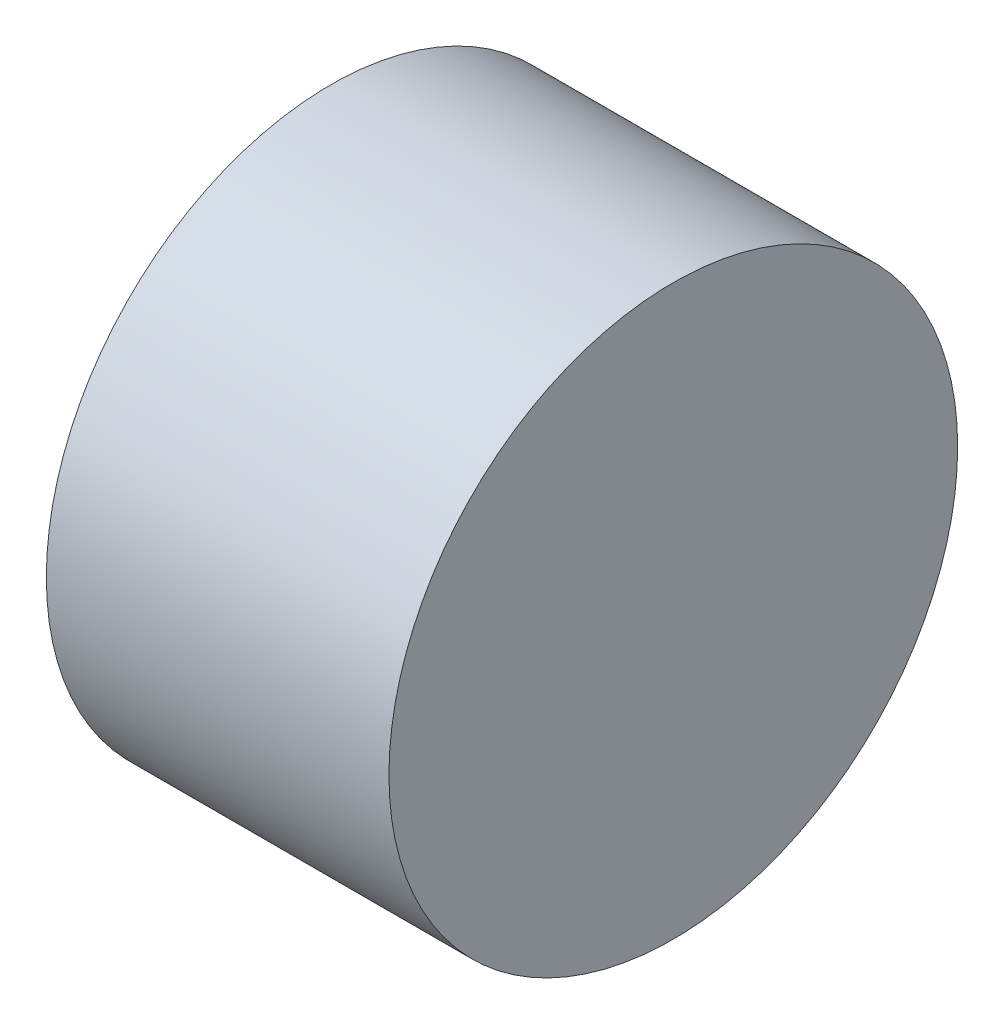
ISO-10303-21;
HEADER;
FILE_DESCRIPTION(('STEP AP214'),'2;1');
FILE_NAME('part.step','',(''),(''),'','','');
FILE_SCHEMA(('AUTOMOTIVE_DESIGN { 1 0 10303 214 1 1 1 1 }'));
ENDSEC;
DATA;
#1=APPLICATION_CONTEXT('core data for automotive mechanical design processes');
#2=APPLICATION_PROTOCOL_DEFINITION('international standard','automotive_design',2000,#1);
#3=PRODUCT_CONTEXT('',#1,'mechanical');
#4=PRODUCT('Part','Part','',(#3));
#5=PRODUCT_RELATED_PRODUCT_CATEGORY('part','',(#4));
#6=PRODUCT_DEFINITION_FORMATION('','',#4);
#7=PRODUCT_DEFINITION_CONTEXT('part definition',#1,'design');
#8=PRODUCT_DEFINITION('design','',#6,#7);
#9=PRODUCT_DEFINITION_SHAPE('','',#8);
#10=(LENGTH_UNIT() NAMED_UNIT(*) SI_UNIT(.MILLI.,.METRE.));
#11=(NAMED_UNIT(*) PLANE_ANGLE_UNIT() SI_UNIT($,.RADIAN.));
#12=(NAMED_UNIT(*) SI_UNIT($,.STERADIAN.) SOLID_ANGLE_UNIT());
#13=UNCERTAINTY_MEASURE_WITH_UNIT(LENGTH_MEASURE(1.E-05),#10,'distance_accuracy_value','');
#14=(GEOMETRIC_REPRESENTATION_CONTEXT(3) GLOBAL_UNCERTAINTY_ASSIGNED_CONTEXT((#13)) GLOBAL_UNIT_ASSIGNED_CONTEXT((#10,
#11,#12)) REPRESENTATION_CONTEXT('',''));
#15=CARTESIAN_POINT('',(0.,0.,0.));
#16=DIRECTION('',(0.,0.,1.));
#17=DIRECTION('',(1.,0.,0.));
#18=AXIS2_PLACEMENT_3D('',#15,#16,#17);
#19=CARTESIAN_POINT('',(0.,0.,0.));
#20=DIRECTION('',(1.,0.,0.));
#21=DIRECTION('',(0.,0.,-1.));
#22=AXIS2_PLACEMENT_3D('',#19,#20,#21);
#23=PLANE('',#22);
#24=CARTESIAN_POINT('',(0.,6.30311603335176E-13,11.1125000000006));
#25=DIRECTION('',(-1.,0.,0.));
#26=DIRECTION('',(0.,0.,1.));
#27=AXIS2_PLACEMENT_3D('',#24,#25,#26);
#28=CIRCLE('',#27,1.98437500000046);
#29=CARTESIAN_POINT('',(0.,6.30311603335176E-13,13.0968750000011));
#30=VERTEX_POINT('',#29);
#31=EDGE_CURVE('E63',#30,#30,#28,.T.);
#32=ORIENTED_EDGE('',*,*,#31,.F.);
#33=EDGE_LOOP('',(#32));
#34=FACE_BOUND('',#33,.T.);
#35=CARTESIAN_POINT('',(0.,-11.1125,1.26062320667035E-12));
#36=DIRECTION('',(-1.,0.,0.));
#37=DIRECTION('',(0.,0.,1.));
#38=AXIS2_PLACEMENT_3D('',#35,#36,#37);
#39=CIRCLE('',#38,1.98437500000128);
#40=CARTESIAN_POINT('',(0.,-11.1125,1.98437500000254));
#41=VERTEX_POINT('',#40);
#42=EDGE_CURVE('E57',#41,#41,#39,.T.);
#43=ORIENTED_EDGE('',*,*,#42,.F.);
#44=EDGE_LOOP('',(#43));
#45=FACE_BOUND('',#44,.T.);
#46=CARTESIAN_POINT('',(0.,-6.31672492090729E-13,-11.1124999999994));
#47=DIRECTION('',(-1.,0.,0.));
#48=DIRECTION('',(0.,0.,1.));
#49=AXIS2_PLACEMENT_3D('',#46,#47,#48);
#50=CIRCLE('',#49,1.9843750000009);
#51=CARTESIAN_POINT('',(0.,-6.31672492090729E-13,-9.12812499999847));
#52=VERTEX_POINT('',#51);
#53=EDGE_CURVE('E51',#52,#52,#50,.T.);
#54=ORIENTED_EDGE('',*,*,#53,.F.);
#55=EDGE_LOOP('',(#54));
#56=FACE_BOUND('',#55,.T.);
#57=CARTESIAN_POINT('',(0.,11.1125,0.));
#58=DIRECTION('',(-1.,0.,0.));
#59=DIRECTION('',(0.,0.,1.));
#60=AXIS2_PLACEMENT_3D('',#57,#58,#59);
#61=CIRCLE('',#60,1.984375);
#62=CARTESIAN_POINT('',(0.,11.1125,1.984375));
#63=VERTEX_POINT('',#62);
#64=EDGE_CURVE('E45',#63,#63,#61,.T.);
#65=ORIENTED_EDGE('',*,*,#64,.F.);
#66=EDGE_LOOP('',(#65));
#67=FACE_BOUND('',#66,.T.);
#68=CARTESIAN_POINT('',(0.,0.,0.));
#69=DIRECTION('',(-1.,0.,0.));
#70=DIRECTION('',(0.,0.,1.));
#71=AXIS2_PLACEMENT_3D('',#68,#69,#70);
#72=CIRCLE('',#71,21.082);
#73=CARTESIAN_POINT('',(0.,0.,21.082));
#74=VERTEX_POINT('',#73);
#75=EDGE_CURVE('E10',#74,#74,#72,.T.);
#76=ORIENTED_EDGE('',*,*,#75,.T.);
#77=EDGE_LOOP('',(#76));
#78=FACE_BOUND('',#77,.T.);
#79=ADVANCED_FACE('F31',(#34,#45,#56,#67,#78),#23,.F.);
#80=CARTESIAN_POINT('',(-29.670962962963,0.,0.));
#81=DIRECTION('',(-1.,0.,0.));
#82=DIRECTION('',(0.,0.,1.));
#83=AXIS2_PLACEMENT_3D('',#80,#81,#82);
#84=CYLINDRICAL_SURFACE('',#83,21.082);
#85=ORIENTED_EDGE('',*,*,#75,.F.);
#86=EDGE_LOOP('',(#85));
#87=FACE_BOUND('',#86,.T.);
#88=CARTESIAN_POINT('',(25.4,0.,0.));
#89=DIRECTION('',(-1.,0.,0.));
#90=DIRECTION('',(0.,0.,1.));
#91=AXIS2_PLACEMENT_3D('',#88,#89,#90);
#92=CIRCLE('',#91,21.082);
#93=CARTESIAN_POINT('',(25.4,0.,21.082));
#94=VERTEX_POINT('',#93);
#95=EDGE_CURVE('E37',#94,#94,#92,.T.);
#96=ORIENTED_EDGE('',*,*,#95,.T.);
#97=EDGE_LOOP('',(#96));
#98=FACE_BOUND('',#97,.T.);
#99=ADVANCED_FACE('F80',(#87,#98),#84,.T.);
#100=CARTESIAN_POINT('',(25.4,0.,0.));
#101=DIRECTION('',(-1.,0.,0.));
#102=DIRECTION('',(0.,0.,1.));
#103=AXIS2_PLACEMENT_3D('',#100,#101,#102);
#104=PLANE('',#103);
#105=ORIENTED_EDGE('',*,*,#95,.F.);
#106=EDGE_LOOP('',(#105));
#107=FACE_BOUND('',#106,.T.);
#108=ADVANCED_FACE('F90',(#107),#104,.F.);
#109=CARTESIAN_POINT('',(6.35,11.1125,0.));
#110=DIRECTION('',(-1.,0.,0.));
#111=DIRECTION('',(0.,0.,1.));
#112=AXIS2_PLACEMENT_3D('',#109,#110,#111);
#113=CYLINDRICAL_SURFACE('',#112,1.984375);
#114=CARTESIAN_POINT('',(6.35,11.1125,0.));
#115=DIRECTION('',(-1.,0.,0.));
#116=DIRECTION('',(0.,0.,1.));
#117=AXIS2_PLACEMENT_3D('',#114,#115,#116);
#118=CIRCLE('',#117,1.984375);
#119=CARTESIAN_POINT('',(6.35,11.1125,1.984375));
#120=VERTEX_POINT('',#119);
#121=EDGE_CURVE('E41',#120,#120,#118,.T.);
#122=ORIENTED_EDGE('',*,*,#121,.F.);
#123=EDGE_LOOP('',(#122));
#124=FACE_BOUND('',#123,.T.);
#125=ORIENTED_EDGE('',*,*,#64,.T.);
#126=EDGE_LOOP('',(#125));
#127=FACE_BOUND('',#126,.T.);
#128=ADVANCED_FACE('F87',(#124,#127),#113,.F.);
#129=CARTESIAN_POINT('',(6.35,11.1125,0.));
#130=DIRECTION('',(-1.,0.,0.));
#131=DIRECTION('',(0.,0.,1.));
#132=AXIS2_PLACEMENT_3D('',#129,#130,#131);
#133=PLANE('',#132);
#134=ORIENTED_EDGE('',*,*,#121,.T.);
#135=EDGE_LOOP('',(#134));
#136=FACE_BOUND('',#135,.T.);
#137=ADVANCED_FACE('F89',(#136),#133,.T.);
#138=CARTESIAN_POINT('',(6.35,-6.31672492090729E-13,-11.1124999999994));
#139=DIRECTION('',(-1.,0.,0.));
#140=DIRECTION('',(0.,0.,1.));
#141=AXIS2_PLACEMENT_3D('',#138,#139,#140);
#142=CYLINDRICAL_SURFACE('',#141,1.9843750000009);
#143=CARTESIAN_POINT('',(6.35,-6.31672492090729E-13,-11.1124999999994));
#144=DIRECTION('',(-1.,0.,0.));
#145=DIRECTION('',(0.,0.,1.));
#146=AXIS2_PLACEMENT_3D('',#143,#144,#145);
#147=CIRCLE('',#146,1.9843750000009);
#148=CARTESIAN_POINT('',(6.35,-6.31672492090729E-13,-9.12812499999847));
#149=VERTEX_POINT('',#148);
#150=EDGE_CURVE('E54',#149,#149,#147,.T.);
#151=ORIENTED_EDGE('',*,*,#150,.F.);
#152=EDGE_LOOP('',(#151));
#153=FACE_BOUND('',#152,.T.);
#154=ORIENTED_EDGE('',*,*,#53,.T.);
#155=EDGE_LOOP('',(#154));
#156=FACE_BOUND('',#155,.T.);
#157=ADVANCED_FACE('F97',(#153,#156),#142,.F.);
#158=CARTESIAN_POINT('',(6.35,-6.31672492090729E-13,-11.1124999999994));
#159=DIRECTION('',(-1.,0.,0.));
#160=DIRECTION('',(0.,0.,1.));
#161=AXIS2_PLACEMENT_3D('',#158,#159,#160);
#162=PLANE('',#161);
#163=ORIENTED_EDGE('',*,*,#150,.T.);
#164=EDGE_LOOP('',(#163));
#165=FACE_BOUND('',#164,.T.);
#166=ADVANCED_FACE('F137',(#165),#162,.T.);
#167=CARTESIAN_POINT('',(6.35,-11.1125,1.26062320667035E-12));
#168=DIRECTION('',(-1.,0.,0.));
#169=DIRECTION('',(0.,0.,1.));
#170=AXIS2_PLACEMENT_3D('',#167,#168,#169);
#171=CYLINDRICAL_SURFACE('',#170,1.98437500000128);
#172=CARTESIAN_POINT('',(6.35,-11.1125,1.26062320667035E-12));
#173=DIRECTION('',(-1.,0.,0.));
#174=DIRECTION('',(0.,0.,1.));
#175=AXIS2_PLACEMENT_3D('',#172,#173,#174);
#176=CIRCLE('',#175,1.98437500000128);
#177=CARTESIAN_POINT('',(6.35,-11.1125,1.98437500000254));
#178=VERTEX_POINT('',#177);
#179=EDGE_CURVE('E60',#178,#178,#176,.T.);
#180=ORIENTED_EDGE('',*,*,#179,.F.);
#181=EDGE_LOOP('',(#180));
#182=FACE_BOUND('',#181,.T.);
#183=ORIENTED_EDGE('',*,*,#42,.T.);
#184=EDGE_LOOP('',(#183));
#185=FACE_BOUND('',#184,.T.);
#186=ADVANCED_FACE('F146',(#182,#185),#171,.F.);
#187=CARTESIAN_POINT('',(6.35,-11.1125,1.26062320667035E-12));
#188=DIRECTION('',(-1.,0.,0.));
#189=DIRECTION('',(0.,0.,1.));
#190=AXIS2_PLACEMENT_3D('',#187,#188,#189);
#191=PLANE('',#190);
#192=ORIENTED_EDGE('',*,*,#179,.T.);
#193=EDGE_LOOP('',(#192));
#194=FACE_BOUND('',#193,.T.);
#195=ADVANCED_FACE('F74',(#194),#191,.T.);
#196=CARTESIAN_POINT('',(6.35,6.30311603335176E-13,11.1125000000006));
#197=DIRECTION('',(-1.,0.,0.));
#198=DIRECTION('',(0.,0.,1.));
#199=AXIS2_PLACEMENT_3D('',#196,#197,#198);
#200=CYLINDRICAL_SURFACE('',#199,1.98437500000046);
#201=CARTESIAN_POINT('',(6.35,6.30311603335176E-13,11.1125000000006));
#202=DIRECTION('',(-1.,0.,0.));
#203=DIRECTION('',(0.,0.,1.));
#204=AXIS2_PLACEMENT_3D('',#201,#202,#203);
#205=CIRCLE('',#204,1.98437500000046);
#206=CARTESIAN_POINT('',(6.35,6.30311603335176E-13,13.0968750000011));
#207=VERTEX_POINT('',#206);
#208=EDGE_CURVE('E49',#207,#207,#205,.T.);
#209=ORIENTED_EDGE('',*,*,#208,.F.);
#210=EDGE_LOOP('',(#209));
#211=FACE_BOUND('',#210,.T.);
#212=ORIENTED_EDGE('',*,*,#31,.T.);
#213=EDGE_LOOP('',(#212));
#214=FACE_BOUND('',#213,.T.);
#215=ADVANCED_FACE('F71',(#211,#214),#200,.F.);
#216=CARTESIAN_POINT('',(6.35,6.30311603335176E-13,11.1125000000006));
#217=DIRECTION('',(-1.,0.,0.));
#218=DIRECTION('',(0.,0.,1.));
#219=AXIS2_PLACEMENT_3D('',#216,#217,#218);
#220=PLANE('',#219);
#221=ORIENTED_EDGE('',*,*,#208,.T.);
#222=EDGE_LOOP('',(#221));
#223=FACE_BOUND('',#222,.T.);
#224=ADVANCED_FACE('F69',(#223),#220,.T.);
#225=CLOSED_SHELL('',(#79,#99,#108,#128,#137,#157,#166,#186,#195,#215,#224));
#226=MANIFOLD_SOLID_BREP('B2',#225);
#227=ADVANCED_BREP_SHAPE_REPRESENTATION('',(#18,#226),#14);
#228=SHAPE_DEFINITION_REPRESENTATION(#9,#227);
ENDSEC;
END-ISO-10303-21;
